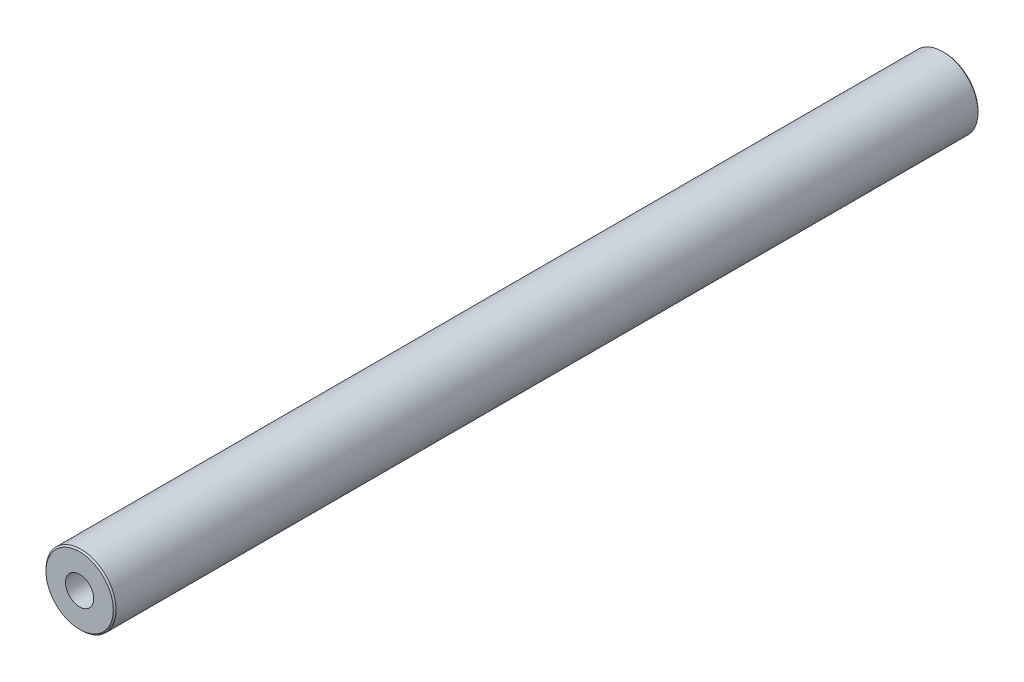
ISO-10303-21;
HEADER;
FILE_DESCRIPTION(('STEP AP214'),'2;1');
FILE_NAME('part.step','',(''),(''),'','','');
FILE_SCHEMA(('AUTOMOTIVE_DESIGN { 1 0 10303 214 1 1 1 1 }'));
ENDSEC;
DATA;
#1=APPLICATION_CONTEXT('core data for automotive mechanical design processes');
#2=APPLICATION_PROTOCOL_DEFINITION('international standard','automotive_design',2000,#1);
#3=PRODUCT_CONTEXT('',#1,'mechanical');
#4=PRODUCT('Part','Part','',(#3));
#5=PRODUCT_RELATED_PRODUCT_CATEGORY('part','',(#4));
#6=PRODUCT_DEFINITION_FORMATION('','',#4);
#7=PRODUCT_DEFINITION_CONTEXT('part definition',#1,'design');
#8=PRODUCT_DEFINITION('design','',#6,#7);
#9=PRODUCT_DEFINITION_SHAPE('','',#8);
#10=(LENGTH_UNIT() NAMED_UNIT(*) SI_UNIT(.MILLI.,.METRE.));
#11=(NAMED_UNIT(*) PLANE_ANGLE_UNIT() SI_UNIT($,.RADIAN.));
#12=(NAMED_UNIT(*) SI_UNIT($,.STERADIAN.) SOLID_ANGLE_UNIT());
#13=UNCERTAINTY_MEASURE_WITH_UNIT(LENGTH_MEASURE(1.E-05),#10,'distance_accuracy_value','');
#14=(GEOMETRIC_REPRESENTATION_CONTEXT(3) GLOBAL_UNCERTAINTY_ASSIGNED_CONTEXT((#13)) GLOBAL_UNIT_ASSIGNED_CONTEXT((#10,
#11,#12)) REPRESENTATION_CONTEXT('',''));
#15=CARTESIAN_POINT('',(0.,0.,0.));
#16=DIRECTION('',(0.,0.,1.));
#17=DIRECTION('',(1.,0.,0.));
#18=AXIS2_PLACEMENT_3D('',#15,#16,#17);
#19=CARTESIAN_POINT('',(0.,0.,78.2574));
#20=DIRECTION('',(0.,0.,-1.));
#21=DIRECTION('',(-1.,0.,0.));
#22=AXIS2_PLACEMENT_3D('',#19,#20,#21);
#23=CYLINDRICAL_SURFACE('',#22,6.35);
#24=CARTESIAN_POINT('',(0.,0.,-78.0034));
#25=DIRECTION('',(0.,0.,1.));
#26=DIRECTION('',(1.,0.,0.));
#27=AXIS2_PLACEMENT_3D('',#24,#25,#26);
#28=CIRCLE('',#27,6.35);
#29=CARTESIAN_POINT('',(6.35,0.,-78.0034));
#30=VERTEX_POINT('',#29);
#31=EDGE_CURVE('E76',#30,#30,#28,.T.);
#32=ORIENTED_EDGE('',*,*,#31,.T.);
#33=EDGE_LOOP('',(#32));
#34=FACE_BOUND('',#33,.T.);
#35=CARTESIAN_POINT('',(0.,0.,78.0034));
#36=DIRECTION('',(0.,0.,1.));
#37=DIRECTION('',(1.,0.,0.));
#38=AXIS2_PLACEMENT_3D('',#35,#36,#37);
#39=CIRCLE('',#38,6.35);
#40=CARTESIAN_POINT('',(6.35,0.,78.0034));
#41=VERTEX_POINT('',#40);
#42=EDGE_CURVE('E73',#41,#41,#39,.F.);
#43=ORIENTED_EDGE('',*,*,#42,.T.);
#44=EDGE_LOOP('',(#43));
#45=FACE_BOUND('',#44,.T.);
#46=ADVANCED_FACE('F38',(#34,#45),#23,.T.);
#47=CARTESIAN_POINT('',(0.,0.,78.2574));
#48=DIRECTION('',(0.,0.,1.));
#49=DIRECTION('',(1.,0.,0.));
#50=AXIS2_PLACEMENT_3D('',#47,#48,#49);
#51=PLANE('',#50);
#52=CARTESIAN_POINT('',(0.,0.,78.2574));
#53=DIRECTION('',(0.,0.,1.));
#54=DIRECTION('',(1.,0.,0.));
#55=AXIS2_PLACEMENT_3D('',#52,#53,#54);
#56=CIRCLE('',#55,6.09599999999999);
#57=CARTESIAN_POINT('',(6.09599999999999,0.,78.2574));
#58=VERTEX_POINT('',#57);
#59=EDGE_CURVE('E11',#58,#58,#56,.T.);
#60=ORIENTED_EDGE('',*,*,#59,.T.);
#61=EDGE_LOOP('',(#60));
#62=FACE_BOUND('',#61,.T.);
#63=CARTESIAN_POINT('',(0.,0.,78.2574));
#64=DIRECTION('',(0.,0.,1.));
#65=DIRECTION('',(1.,0.,0.));
#66=AXIS2_PLACEMENT_3D('',#63,#64,#65);
#67=CIRCLE('',#66,2.5527);
#68=CARTESIAN_POINT('',(2.5527,0.,78.2574));
#69=VERTEX_POINT('',#68);
#70=EDGE_CURVE('E62',#69,#69,#67,.T.);
#71=ORIENTED_EDGE('',*,*,#70,.F.);
#72=EDGE_LOOP('',(#71));
#73=FACE_BOUND('',#72,.T.);
#74=ADVANCED_FACE('F91',(#62,#73),#51,.T.);
#75=CARTESIAN_POINT('',(0.,0.,-78.2574));
#76=DIRECTION('',(0.,0.,1.));
#77=DIRECTION('',(1.,0.,0.));
#78=AXIS2_PLACEMENT_3D('',#75,#76,#77);
#79=PLANE('',#78);
#80=CARTESIAN_POINT('',(0.,0.,-78.2574));
#81=DIRECTION('',(0.,0.,1.));
#82=DIRECTION('',(1.,0.,0.));
#83=AXIS2_PLACEMENT_3D('',#80,#81,#82);
#84=CIRCLE('',#83,6.09600000000003);
#85=CARTESIAN_POINT('',(6.09600000000003,0.,-78.2574));
#86=VERTEX_POINT('',#85);
#87=EDGE_CURVE('E46',#86,#86,#84,.F.);
#88=ORIENTED_EDGE('',*,*,#87,.T.);
#89=EDGE_LOOP('',(#88));
#90=FACE_BOUND('',#89,.T.);
#91=CARTESIAN_POINT('',(0.,0.,-78.2574));
#92=DIRECTION('',(0.,0.,-1.));
#93=DIRECTION('',(-1.,0.,0.));
#94=AXIS2_PLACEMENT_3D('',#91,#92,#93);
#95=CIRCLE('',#94,2.5527);
#96=CARTESIAN_POINT('',(-2.5527,0.,-78.2574));
#97=VERTEX_POINT('',#96);
#98=EDGE_CURVE('E63',#97,#97,#95,.T.);
#99=ORIENTED_EDGE('',*,*,#98,.F.);
#100=EDGE_LOOP('',(#99));
#101=FACE_BOUND('',#100,.T.);
#102=ADVANCED_FACE('F81',(#90,#101),#79,.F.);
#103=CARTESIAN_POINT('',(0.,0.,38.2574));
#104=DIRECTION('',(0.,0.,1.));
#105=DIRECTION('',(1.,0.,0.));
#106=AXIS2_PLACEMENT_3D('',#103,#104,#105);
#107=CONICAL_SURFACE('',#106,2.55269999999999,1.02974425867665);
#108=CARTESIAN_POINT('',(0.,0.,36.7235830978083));
#109=VERTEX_POINT('',#108);
#110=VERTEX_LOOP('',#109);
#111=FACE_BOUND('',#110,.T.);
#112=CARTESIAN_POINT('',(0.,0.,38.2574));
#113=DIRECTION('',(0.,0.,1.));
#114=DIRECTION('',(1.,0.,0.));
#115=AXIS2_PLACEMENT_3D('',#112,#113,#114);
#116=CIRCLE('',#115,2.55269999999999);
#117=CARTESIAN_POINT('',(2.55269999999999,0.,38.2574));
#118=VERTEX_POINT('',#117);
#119=EDGE_CURVE('E66',#118,#118,#116,.T.);
#120=ORIENTED_EDGE('',*,*,#119,.T.);
#121=EDGE_LOOP('',(#120));
#122=FACE_BOUND('',#121,.T.);
#123=ADVANCED_FACE('F105',(#111,#122),#107,.F.);
#124=CARTESIAN_POINT('',(0.,0.,78.2574));
#125=DIRECTION('',(0.,0.,1.));
#126=DIRECTION('',(1.,0.,0.));
#127=AXIS2_PLACEMENT_3D('',#124,#125,#126);
#128=CYLINDRICAL_SURFACE('',#127,2.55269999999999);
#129=ORIENTED_EDGE('',*,*,#119,.F.);
#130=EDGE_LOOP('',(#129));
#131=FACE_BOUND('',#130,.T.);
#132=ORIENTED_EDGE('',*,*,#70,.T.);
#133=EDGE_LOOP('',(#132));
#134=FACE_BOUND('',#133,.T.);
#135=ADVANCED_FACE('F56',(#131,#134),#128,.F.);
#136=CARTESIAN_POINT('',(0.,0.,-38.2574));
#137=DIRECTION('',(0.,0.,-1.));
#138=DIRECTION('',(-1.,0.,0.));
#139=AXIS2_PLACEMENT_3D('',#136,#137,#138);
#140=CONICAL_SURFACE('',#139,2.55269999999999,1.02974425867665);
#141=CARTESIAN_POINT('',(0.,0.,-36.7235830978083));
#142=VERTEX_POINT('',#141);
#143=VERTEX_LOOP('',#142);
#144=FACE_BOUND('',#143,.T.);
#145=CARTESIAN_POINT('',(0.,0.,-38.2574));
#146=DIRECTION('',(0.,0.,-1.));
#147=DIRECTION('',(-1.,0.,0.));
#148=AXIS2_PLACEMENT_3D('',#145,#146,#147);
#149=CIRCLE('',#148,2.55269999999999);
#150=CARTESIAN_POINT('',(-2.55269999999999,0.,-38.2574));
#151=VERTEX_POINT('',#150);
#152=EDGE_CURVE('E60',#151,#151,#149,.T.);
#153=ORIENTED_EDGE('',*,*,#152,.T.);
#154=EDGE_LOOP('',(#153));
#155=FACE_BOUND('',#154,.T.);
#156=ADVANCED_FACE('F52',(#144,#155),#140,.F.);
#157=CARTESIAN_POINT('',(0.,0.,-78.2574));
#158=DIRECTION('',(0.,0.,-1.));
#159=DIRECTION('',(-1.,0.,0.));
#160=AXIS2_PLACEMENT_3D('',#157,#158,#159);
#161=CYLINDRICAL_SURFACE('',#160,2.55269999999999);
#162=ORIENTED_EDGE('',*,*,#152,.F.);
#163=EDGE_LOOP('',(#162));
#164=FACE_BOUND('',#163,.T.);
#165=ORIENTED_EDGE('',*,*,#98,.T.);
#166=EDGE_LOOP('',(#165));
#167=FACE_BOUND('',#166,.T.);
#168=ADVANCED_FACE('F55',(#164,#167),#161,.F.);
#169=CARTESIAN_POINT('',(0.,0.,-78.0034));
#170=DIRECTION('',(0.,0.,1.));
#171=DIRECTION('',(1.,0.,0.));
#172=AXIS2_PLACEMENT_3D('',#169,#170,#171);
#173=CONICAL_SURFACE('',#172,6.35,0.785398163397431);
#174=ORIENTED_EDGE('',*,*,#87,.F.);
#175=EDGE_LOOP('',(#174));
#176=FACE_BOUND('',#175,.T.);
#177=ORIENTED_EDGE('',*,*,#31,.F.);
#178=EDGE_LOOP('',(#177));
#179=FACE_BOUND('',#178,.T.);
#180=ADVANCED_FACE('F84',(#176,#179),#173,.T.);
#181=CARTESIAN_POINT('',(0.,0.,78.2574));
#182=DIRECTION('',(0.,0.,-1.));
#183=DIRECTION('',(-1.,0.,0.));
#184=AXIS2_PLACEMENT_3D('',#181,#182,#183);
#185=CONICAL_SURFACE('',#184,6.09599999999999,0.785398163397458);
#186=ORIENTED_EDGE('',*,*,#42,.F.);
#187=EDGE_LOOP('',(#186));
#188=FACE_BOUND('',#187,.T.);
#189=ORIENTED_EDGE('',*,*,#59,.F.);
#190=EDGE_LOOP('',(#189));
#191=FACE_BOUND('',#190,.T.);
#192=ADVANCED_FACE('F40',(#188,#191),#185,.T.);
#193=CLOSED_SHELL('',(#46,#74,#102,#123,#135,#156,#168,#180,#192));
#194=MANIFOLD_SOLID_BREP('B2',#193);
#195=ADVANCED_BREP_SHAPE_REPRESENTATION('',(#18,#194),#14);
#196=SHAPE_DEFINITION_REPRESENTATION(#9,#195);
ENDSEC;
END-ISO-10303-21;
